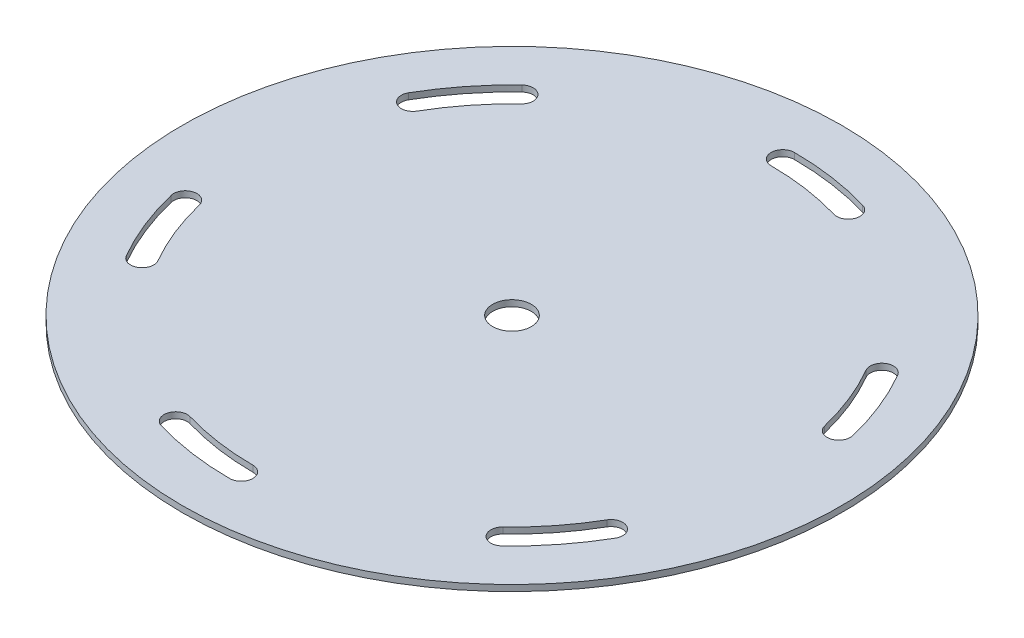
ISO-10303-21;
HEADER;
FILE_DESCRIPTION(('STEP AP214'),'2;1');
FILE_NAME('part.step','',(''),(''),'','','');
FILE_SCHEMA(('AUTOMOTIVE_DESIGN { 1 0 10303 214 1 1 1 1 }'));
ENDSEC;
DATA;
#1=APPLICATION_CONTEXT('core data for automotive mechanical design processes');
#2=APPLICATION_PROTOCOL_DEFINITION('international standard','automotive_design',2000,#1);
#3=PRODUCT_CONTEXT('',#1,'mechanical');
#4=PRODUCT('Part','Part','',(#3));
#5=PRODUCT_RELATED_PRODUCT_CATEGORY('part','',(#4));
#6=PRODUCT_DEFINITION_FORMATION('','',#4);
#7=PRODUCT_DEFINITION_CONTEXT('part definition',#1,'design');
#8=PRODUCT_DEFINITION('design','',#6,#7);
#9=PRODUCT_DEFINITION_SHAPE('','',#8);
#10=(LENGTH_UNIT() NAMED_UNIT(*) SI_UNIT(.MILLI.,.METRE.));
#11=(NAMED_UNIT(*) PLANE_ANGLE_UNIT() SI_UNIT($,.RADIAN.));
#12=(NAMED_UNIT(*) SI_UNIT($,.STERADIAN.) SOLID_ANGLE_UNIT());
#13=UNCERTAINTY_MEASURE_WITH_UNIT(LENGTH_MEASURE(1.E-05),#10,'distance_accuracy_value','');
#14=(GEOMETRIC_REPRESENTATION_CONTEXT(3) GLOBAL_UNCERTAINTY_ASSIGNED_CONTEXT((#13)) GLOBAL_UNIT_ASSIGNED_CONTEXT((#10,
#11,#12)) REPRESENTATION_CONTEXT('',''));
#15=CARTESIAN_POINT('',(0.,0.,0.));
#16=DIRECTION('',(0.,0.,1.));
#17=DIRECTION('',(1.,0.,0.));
#18=AXIS2_PLACEMENT_3D('',#15,#16,#17);
#19=CARTESIAN_POINT('',(0.,1.5875,0.));
#20=DIRECTION('',(0.,1.,0.));
#21=DIRECTION('',(0.,0.,1.));
#22=AXIS2_PLACEMENT_3D('',#19,#20,#21);
#23=PLANE('',#22);
#24=CARTESIAN_POINT('',(0.,1.5875,0.));
#25=DIRECTION('',(0.,1.,0.));
#26=DIRECTION('',(0.,0.,1.));
#27=AXIS2_PLACEMENT_3D('',#24,#25,#26);
#28=CIRCLE('',#27,85.2);
#29=CARTESIAN_POINT('',(0.,1.5875,85.2));
#30=VERTEX_POINT('',#29);
#31=EDGE_CURVE('E11',#30,#30,#28,.T.);
#32=ORIENTED_EDGE('',*,*,#31,.T.);
#33=EDGE_LOOP('',(#32));
#34=FACE_BOUND('',#33,.T.);
#35=CARTESIAN_POINT('',(0.,1.5875,0.));
#36=DIRECTION('',(0.,1.,0.));
#37=DIRECTION('',(0.,0.,1.));
#38=AXIS2_PLACEMENT_3D('',#35,#36,#37);
#39=CIRCLE('',#38,5.);
#40=CARTESIAN_POINT('',(0.,1.5875,5.));
#41=VERTEX_POINT('',#40);
#42=EDGE_CURVE('E385',#41,#41,#39,.T.);
#43=ORIENTED_EDGE('',*,*,#42,.F.);
#44=EDGE_LOOP('',(#43));
#45=FACE_BOUND('',#44,.T.);
#46=CARTESIAN_POINT('',(2.97021924916889E-12,1.5875,0.));
#47=DIRECTION('',(0.,1.,0.));
#48=DIRECTION('',(0.,0.,1.));
#49=AXIS2_PLACEMENT_3D('',#46,#47,#48);
#50=CIRCLE('',#49,73.0000000000003);
#51=CARTESIAN_POINT('',(70.9610611468298,1.5875,-17.132653061226));
#52=VERTEX_POINT('',#51);
#53=CARTESIAN_POINT('',(63.2198544762673,1.5875,-36.5));
#54=VERTEX_POINT('',#53);
#55=EDGE_CURVE('E356',#52,#54,#50,.T.);
#56=ORIENTED_EDGE('',*,*,#55,.F.);
#57=CARTESIAN_POINT('',(68.0448531544948,1.5875,-16.4285714285725));
#58=DIRECTION('',(0.,1.,0.));
#59=DIRECTION('',(0.,0.,1.));
#60=AXIS2_PLACEMENT_3D('',#57,#58,#59);
#61=CIRCLE('',#60,3.);
#62=CARTESIAN_POINT('',(65.1286451621581,1.5875,-15.7244897959186));
#63=VERTEX_POINT('',#62);
#64=EDGE_CURVE('E354',#63,#52,#61,.T.);
#65=ORIENTED_EDGE('',*,*,#64,.F.);
#66=CARTESIAN_POINT('',(2.97021924916889E-12,1.5875,0.));
#67=DIRECTION('',(0.,-1.,0.));
#68=DIRECTION('',(0.,0.,1.));
#69=AXIS2_PLACEMENT_3D('',#66,#67,#68);
#70=CIRCLE('',#69,66.999999999999);
#71=CARTESIAN_POINT('',(58.023702053559,1.5875,-33.5000000000002));
#72=VERTEX_POINT('',#71);
#73=EDGE_CURVE('E362',#72,#63,#70,.T.);
#74=ORIENTED_EDGE('',*,*,#73,.F.);
#75=CARTESIAN_POINT('',(60.6217782649108,1.5875,-34.9999999999999));
#76=DIRECTION('',(0.,1.,0.));
#77=DIRECTION('',(0.,0.,1.));
#78=AXIS2_PLACEMENT_3D('',#75,#76,#77);
#79=CIRCLE('',#78,3.00000000000128);
#80=EDGE_CURVE('E359',#54,#72,#79,.T.);
#81=ORIENTED_EDGE('',*,*,#80,.F.);
#82=EDGE_LOOP('',(#56,#65,#74,#81));
#83=FACE_BOUND('',#82,.T.);
#84=CARTESIAN_POINT('',(2.97021924916889E-12,1.5875,0.));
#85=DIRECTION('',(0.,1.,0.));
#86=DIRECTION('',(0.,0.,1.));
#87=AXIS2_PLACEMENT_3D('',#84,#85,#86);
#88=CIRCLE('',#87,73.);
#89=CARTESIAN_POINT('',(20.643217788171,1.5875,-70.0204081632653));
#90=VERTEX_POINT('',#89);
#91=CARTESIAN_POINT('',(-4.89621647336173E-13,1.5875,-73.));
#92=VERTEX_POINT('',#91);
#93=EDGE_CURVE('E325',#90,#92,#88,.T.);
#94=ORIENTED_EDGE('',*,*,#93,.F.);
#95=CARTESIAN_POINT('',(19.7948663722189,1.5875,-67.1428571428571));
#96=DIRECTION('',(0.,1.,0.));
#97=DIRECTION('',(0.,0.,1.));
#98=AXIS2_PLACEMENT_3D('',#95,#96,#97);
#99=CIRCLE('',#98,3.);
#100=CARTESIAN_POINT('',(18.9465149562668,1.5875,-64.2653061224489));
#101=VERTEX_POINT('',#100);
#102=EDGE_CURVE('E323',#101,#90,#99,.T.);
#103=ORIENTED_EDGE('',*,*,#102,.F.);
#104=CARTESIAN_POINT('',(2.97021924916889E-12,1.5875,0.));
#105=DIRECTION('',(0.,-1.,0.));
#106=DIRECTION('',(0.,0.,1.));
#107=AXIS2_PLACEMENT_3D('',#104,#105,#106);
#108=CIRCLE('',#107,67.);
#109=CARTESIAN_POINT('',(0.,1.5875,-67.));
#110=VERTEX_POINT('',#109);
#111=EDGE_CURVE('E331',#110,#101,#108,.T.);
#112=ORIENTED_EDGE('',*,*,#111,.F.);
#113=CARTESIAN_POINT('',(0.,1.5875,-70.));
#114=DIRECTION('',(0.,1.,0.));
#115=DIRECTION('',(0.,0.,1.));
#116=AXIS2_PLACEMENT_3D('',#113,#114,#115);
#117=CIRCLE('',#116,3.);
#118=EDGE_CURVE('E328',#92,#110,#117,.T.);
#119=ORIENTED_EDGE('',*,*,#118,.F.);
#120=EDGE_LOOP('',(#94,#103,#112,#119));
#121=FACE_BOUND('',#120,.T.);
#122=CARTESIAN_POINT('',(2.97021924916889E-12,1.5875,0.));
#123=DIRECTION('',(0.,1.,0.));
#124=DIRECTION('',(0.,0.,1.));
#125=AXIS2_PLACEMENT_3D('',#122,#123,#124);
#126=CIRCLE('',#125,72.9999999999994);
#127=CARTESIAN_POINT('',(50.3178433586606,1.5875,52.8877551020414));
#128=VERTEX_POINT('',#127);
#129=CARTESIAN_POINT('',(63.2198544762658,1.5875,36.5000000000008));
#130=VERTEX_POINT('',#129);
#131=EDGE_CURVE('E294',#128,#130,#126,.T.);
#132=ORIENTED_EDGE('',*,*,#131,.F.);
#133=CARTESIAN_POINT('',(48.2499867822783,1.5875,50.7142857142881));
#134=DIRECTION('',(0.,1.,0.));
#135=DIRECTION('',(0.,0.,1.));
#136=AXIS2_PLACEMENT_3D('',#133,#134,#135);
#137=CIRCLE('',#136,2.99999999999999);
#138=CARTESIAN_POINT('',(46.1821302058943,1.5875,48.5408163265328));
#139=VERTEX_POINT('',#138);
#140=EDGE_CURVE('E292',#139,#128,#137,.T.);
#141=ORIENTED_EDGE('',*,*,#140,.F.);
#142=CARTESIAN_POINT('',(2.97021924916889E-12,1.5875,0.));
#143=DIRECTION('',(0.,-1.,0.));
#144=DIRECTION('',(0.,0.,1.));
#145=AXIS2_PLACEMENT_3D('',#142,#143,#144);
#146=CIRCLE('',#145,67.0000000000007);
#147=CARTESIAN_POINT('',(58.0237020535609,1.5875,33.5000000000004));
#148=VERTEX_POINT('',#147);
#149=EDGE_CURVE('E300',#148,#139,#146,.T.);
#150=ORIENTED_EDGE('',*,*,#149,.F.);
#151=CARTESIAN_POINT('',(60.6217782649138,1.5875,34.9999999999999));
#152=DIRECTION('',(0.,1.,0.));
#153=DIRECTION('',(0.,0.,1.));
#154=AXIS2_PLACEMENT_3D('',#151,#152,#153);
#155=CIRCLE('',#154,2.99999999999871);
#156=EDGE_CURVE('E297',#130,#148,#155,.T.);
#157=ORIENTED_EDGE('',*,*,#156,.F.);
#158=EDGE_LOOP('',(#132,#141,#150,#157));
#159=FACE_BOUND('',#158,.T.);
#160=CARTESIAN_POINT('',(2.97021924916889E-12,1.5875,0.));
#161=DIRECTION('',(0.,1.,0.));
#162=DIRECTION('',(0.,0.,1.));
#163=AXIS2_PLACEMENT_3D('',#160,#161,#162);
#164=CIRCLE('',#163,73.);
#165=CARTESIAN_POINT('',(-20.6432177881651,1.5875,70.0204081632653));
#166=VERTEX_POINT('',#165);
#167=CARTESIAN_POINT('',(2.97021924916889E-12,1.5875,73.));
#168=VERTEX_POINT('',#167);
#169=EDGE_CURVE('E263',#166,#168,#164,.T.);
#170=ORIENTED_EDGE('',*,*,#169,.F.);
#171=CARTESIAN_POINT('',(-19.7948663722129,1.5875,67.1428571428571));
#172=DIRECTION('',(0.,1.,0.));
#173=DIRECTION('',(0.,0.,1.));
#174=AXIS2_PLACEMENT_3D('',#171,#172,#173);
#175=CIRCLE('',#174,3.);
#176=CARTESIAN_POINT('',(-18.9465149562609,1.5875,64.2653061224489));
#177=VERTEX_POINT('',#176);
#178=EDGE_CURVE('E261',#177,#166,#175,.T.);
#179=ORIENTED_EDGE('',*,*,#178,.F.);
#180=CARTESIAN_POINT('',(2.97021924916889E-12,1.5875,0.));
#181=DIRECTION('',(0.,-1.,0.));
#182=DIRECTION('',(0.,0.,1.));
#183=AXIS2_PLACEMENT_3D('',#180,#181,#182);
#184=CIRCLE('',#183,67.);
#185=CARTESIAN_POINT('',(2.97021924916889E-12,1.5875,67.));
#186=VERTEX_POINT('',#185);
#187=EDGE_CURVE('E269',#186,#177,#184,.T.);
#188=ORIENTED_EDGE('',*,*,#187,.F.);
#189=CARTESIAN_POINT('',(2.82051813152109E-12,1.5875,70.));
#190=DIRECTION('',(0.,1.,0.));
#191=DIRECTION('',(0.,0.,1.));
#192=AXIS2_PLACEMENT_3D('',#189,#190,#191);
#193=CIRCLE('',#192,3.);
#194=EDGE_CURVE('E266',#168,#186,#193,.T.);
#195=ORIENTED_EDGE('',*,*,#194,.F.);
#196=EDGE_LOOP('',(#170,#179,#188,#195));
#197=FACE_BOUND('',#196,.T.);
#198=CARTESIAN_POINT('',(2.97021924916889E-12,1.5875,0.));
#199=DIRECTION('',(0.,1.,0.));
#200=DIRECTION('',(0.,0.,1.));
#201=AXIS2_PLACEMENT_3D('',#198,#199,#200);
#202=CIRCLE('',#201,73.);
#203=CARTESIAN_POINT('',(-70.9610611468241,1.5875,17.1326530612243));
#204=VERTEX_POINT('',#203);
#205=CARTESIAN_POINT('',(-63.2198544762609,1.5875,36.5000000000002));
#206=VERTEX_POINT('',#205);
#207=EDGE_CURVE('E232',#204,#206,#202,.T.);
#208=ORIENTED_EDGE('',*,*,#207,.F.);
#209=CARTESIAN_POINT('',(-68.0448531544887,1.5875,16.4285714285713));
#210=DIRECTION('',(0.,1.,0.));
#211=DIRECTION('',(0.,0.,1.));
#212=AXIS2_PLACEMENT_3D('',#209,#210,#211);
#213=CIRCLE('',#212,2.99999999999999);
#214=CARTESIAN_POINT('',(-65.1286451621534,1.5875,15.7244897959182));
#215=VERTEX_POINT('',#214);
#216=EDGE_CURVE('E230',#215,#204,#213,.T.);
#217=ORIENTED_EDGE('',*,*,#216,.F.);
#218=CARTESIAN_POINT('',(2.97021924916889E-12,1.5875,0.));
#219=DIRECTION('',(0.,-1.,0.));
#220=DIRECTION('',(0.,0.,1.));
#221=AXIS2_PLACEMENT_3D('',#218,#219,#220);
#222=CIRCLE('',#221,67.);
#223=CARTESIAN_POINT('',(-58.0237020535545,1.5875,33.4999999999999));
#224=VERTEX_POINT('',#223);
#225=EDGE_CURVE('E238',#224,#215,#222,.T.);
#226=ORIENTED_EDGE('',*,*,#225,.F.);
#227=CARTESIAN_POINT('',(-60.6217782649078,1.5875,34.9999999999998));
#228=DIRECTION('',(0.,1.,0.));
#229=DIRECTION('',(0.,0.,1.));
#230=AXIS2_PLACEMENT_3D('',#227,#228,#229);
#231=CIRCLE('',#230,3.);
#232=EDGE_CURVE('E235',#206,#224,#231,.T.);
#233=ORIENTED_EDGE('',*,*,#232,.F.);
#234=EDGE_LOOP('',(#208,#217,#226,#233));
#235=FACE_BOUND('',#234,.T.);
#236=CARTESIAN_POINT('',(2.97021924916889E-12,1.5875,0.));
#237=DIRECTION('',(0.,1.,0.));
#238=DIRECTION('',(0.,0.,1.));
#239=AXIS2_PLACEMENT_3D('',#236,#237,#238);
#240=CIRCLE('',#239,73.0000000000013);
#241=CARTESIAN_POINT('',(-50.3178433586569,1.5875,-52.8877551020419));
#242=VERTEX_POINT('',#241);
#243=CARTESIAN_POINT('',(-63.2198544762627,1.5875,-36.4999999999997));
#244=VERTEX_POINT('',#243);
#245=EDGE_CURVE('E202',#242,#244,#240,.T.);
#246=ORIENTED_EDGE('',*,*,#245,.F.);
#247=CARTESIAN_POINT('',(-48.2499867822728,1.5875,-50.7142857142858));
#248=DIRECTION('',(0.,1.,0.));
#249=DIRECTION('',(0.,0.,1.));
#250=AXIS2_PLACEMENT_3D('',#247,#248,#249);
#251=CIRCLE('',#250,3.);
#252=CARTESIAN_POINT('',(-46.1821302058904,1.5875,-48.5408163265317));
#253=VERTEX_POINT('',#252);
#254=EDGE_CURVE('E194',#253,#242,#251,.T.);
#255=ORIENTED_EDGE('',*,*,#254,.F.);
#256=CARTESIAN_POINT('',(2.97021924916889E-12,1.5875,0.));
#257=DIRECTION('',(0.,-1.,0.));
#258=DIRECTION('',(0.,0.,1.));
#259=AXIS2_PLACEMENT_3D('',#256,#257,#258);
#260=CIRCLE('',#259,67.0000000000013);
#261=CARTESIAN_POINT('',(-58.0237020535556,1.5875,-33.5000000000005));
#262=VERTEX_POINT('',#261);
#263=EDGE_CURVE('E216',#262,#253,#260,.T.);
#264=ORIENTED_EDGE('',*,*,#263,.F.);
#265=CARTESIAN_POINT('',(-60.6217782649103,1.5875,-35.0000000000007));
#266=DIRECTION('',(0.,1.,0.));
#267=DIRECTION('',(0.,0.,1.));
#268=AXIS2_PLACEMENT_3D('',#265,#266,#267);
#269=CIRCLE('',#268,3.);
#270=EDGE_CURVE('E214',#244,#262,#269,.T.);
#271=ORIENTED_EDGE('',*,*,#270,.F.);
#272=EDGE_LOOP('',(#246,#255,#264,#271));
#273=FACE_BOUND('',#272,.T.);
#274=ADVANCED_FACE('F33',(#34,#45,#83,#121,#159,#197,#235,#273),#23,.T.);
#275=CARTESIAN_POINT('',(0.,0.,0.));
#276=DIRECTION('',(0.,1.,0.));
#277=DIRECTION('',(0.,0.,1.));
#278=AXIS2_PLACEMENT_3D('',#275,#276,#277);
#279=PLANE('',#278);
#280=CARTESIAN_POINT('',(-68.0448531544887,0.,16.4285714285713));
#281=DIRECTION('',(0.,1.,0.));
#282=DIRECTION('',(0.,0.,1.));
#283=AXIS2_PLACEMENT_3D('',#280,#281,#282);
#284=CIRCLE('',#283,2.99999999999999);
#285=CARTESIAN_POINT('',(-65.1286451621534,0.,15.7244897959182));
#286=VERTEX_POINT('',#285);
#287=CARTESIAN_POINT('',(-70.9610611468241,0.,17.1326530612243));
#288=VERTEX_POINT('',#287);
#289=EDGE_CURVE('E210',#286,#288,#284,.T.);
#290=ORIENTED_EDGE('',*,*,#289,.T.);
#291=CARTESIAN_POINT('',(2.97021924916889E-12,0.,0.));
#292=DIRECTION('',(0.,1.,0.));
#293=DIRECTION('',(0.,0.,1.));
#294=AXIS2_PLACEMENT_3D('',#291,#292,#293);
#295=CIRCLE('',#294,73.);
#296=CARTESIAN_POINT('',(-63.2198544762609,0.,36.5000000000002));
#297=VERTEX_POINT('',#296);
#298=EDGE_CURVE('E243',#288,#297,#295,.T.);
#299=ORIENTED_EDGE('',*,*,#298,.T.);
#300=CARTESIAN_POINT('',(-60.6217782649078,0.,34.9999999999998));
#301=DIRECTION('',(0.,1.,0.));
#302=DIRECTION('',(0.,0.,1.));
#303=AXIS2_PLACEMENT_3D('',#300,#301,#302);
#304=CIRCLE('',#303,3.);
#305=CARTESIAN_POINT('',(-58.0237020535545,0.,33.4999999999999));
#306=VERTEX_POINT('',#305);
#307=EDGE_CURVE('E246',#297,#306,#304,.T.);
#308=ORIENTED_EDGE('',*,*,#307,.T.);
#309=CARTESIAN_POINT('',(2.97021924916889E-12,0.,0.));
#310=DIRECTION('',(0.,-1.,0.));
#311=DIRECTION('',(0.,0.,1.));
#312=AXIS2_PLACEMENT_3D('',#309,#310,#311);
#313=CIRCLE('',#312,67.);
#314=EDGE_CURVE('E233',#306,#286,#313,.T.);
#315=ORIENTED_EDGE('',*,*,#314,.T.);
#316=EDGE_LOOP('',(#290,#299,#308,#315));
#317=FACE_BOUND('',#316,.T.);
#318=CARTESIAN_POINT('',(48.2499867822783,0.,50.7142857142881));
#319=DIRECTION('',(0.,1.,0.));
#320=DIRECTION('',(0.,0.,1.));
#321=AXIS2_PLACEMENT_3D('',#318,#319,#320);
#322=CIRCLE('',#321,2.99999999999999);
#323=CARTESIAN_POINT('',(46.1821302058943,0.,48.5408163265328));
#324=VERTEX_POINT('',#323);
#325=CARTESIAN_POINT('',(50.3178433586606,0.,52.8877551020414));
#326=VERTEX_POINT('',#325);
#327=EDGE_CURVE('E291',#324,#326,#322,.T.);
#328=ORIENTED_EDGE('',*,*,#327,.T.);
#329=CARTESIAN_POINT('',(2.97021924916889E-12,0.,0.));
#330=DIRECTION('',(0.,1.,0.));
#331=DIRECTION('',(0.,0.,1.));
#332=AXIS2_PLACEMENT_3D('',#329,#330,#331);
#333=CIRCLE('',#332,72.9999999999994);
#334=CARTESIAN_POINT('',(63.2198544762658,0.,36.5000000000008));
#335=VERTEX_POINT('',#334);
#336=EDGE_CURVE('E305',#326,#335,#333,.T.);
#337=ORIENTED_EDGE('',*,*,#336,.T.);
#338=CARTESIAN_POINT('',(60.6217782649138,0.,34.9999999999999));
#339=DIRECTION('',(0.,1.,0.));
#340=DIRECTION('',(0.,0.,1.));
#341=AXIS2_PLACEMENT_3D('',#338,#339,#340);
#342=CIRCLE('',#341,2.99999999999871);
#343=CARTESIAN_POINT('',(58.0237020535614,0.,33.5000000000007));
#344=VERTEX_POINT('',#343);
#345=EDGE_CURVE('E308',#335,#344,#342,.T.);
#346=ORIENTED_EDGE('',*,*,#345,.T.);
#347=CARTESIAN_POINT('',(2.97021924916889E-12,0.,0.));
#348=DIRECTION('',(0.,-1.,0.));
#349=DIRECTION('',(0.,0.,1.));
#350=AXIS2_PLACEMENT_3D('',#347,#348,#349);
#351=CIRCLE('',#350,67.0000000000007);
#352=EDGE_CURVE('E295',#344,#324,#351,.T.);
#353=ORIENTED_EDGE('',*,*,#352,.T.);
#354=EDGE_LOOP('',(#328,#337,#346,#353));
#355=FACE_BOUND('',#354,.T.);
#356=CARTESIAN_POINT('',(68.0448531544948,0.,-16.4285714285725));
#357=DIRECTION('',(0.,1.,0.));
#358=DIRECTION('',(0.,0.,1.));
#359=AXIS2_PLACEMENT_3D('',#356,#357,#358);
#360=CIRCLE('',#359,3.);
#361=CARTESIAN_POINT('',(65.1286451621581,0.,-15.7244897959186));
#362=VERTEX_POINT('',#361);
#363=CARTESIAN_POINT('',(70.9610611468298,0.,-17.132653061226));
#364=VERTEX_POINT('',#363);
#365=EDGE_CURVE('E353',#362,#364,#360,.T.);
#366=ORIENTED_EDGE('',*,*,#365,.T.);
#367=CARTESIAN_POINT('',(2.97021924916889E-12,0.,0.));
#368=DIRECTION('',(0.,1.,0.));
#369=DIRECTION('',(0.,0.,1.));
#370=AXIS2_PLACEMENT_3D('',#367,#368,#369);
#371=CIRCLE('',#370,73.0000000000003);
#372=CARTESIAN_POINT('',(63.2198544762673,0.,-36.5));
#373=VERTEX_POINT('',#372);
#374=EDGE_CURVE('E367',#364,#373,#371,.T.);
#375=ORIENTED_EDGE('',*,*,#374,.T.);
#376=CARTESIAN_POINT('',(60.6217782649108,0.,-34.9999999999999));
#377=DIRECTION('',(0.,1.,0.));
#378=DIRECTION('',(0.,0.,1.));
#379=AXIS2_PLACEMENT_3D('',#376,#377,#378);
#380=CIRCLE('',#379,3.00000000000128);
#381=CARTESIAN_POINT('',(58.0237020535566,0.,-33.4999999999988));
#382=VERTEX_POINT('',#381);
#383=EDGE_CURVE('E370',#373,#382,#380,.T.);
#384=ORIENTED_EDGE('',*,*,#383,.T.);
#385=CARTESIAN_POINT('',(2.97021924916889E-12,0.,0.));
#386=DIRECTION('',(0.,-1.,0.));
#387=DIRECTION('',(0.,0.,1.));
#388=AXIS2_PLACEMENT_3D('',#385,#386,#387);
#389=CIRCLE('',#388,66.999999999999);
#390=EDGE_CURVE('E357',#382,#362,#389,.T.);
#391=ORIENTED_EDGE('',*,*,#390,.T.);
#392=EDGE_LOOP('',(#366,#375,#384,#391));
#393=FACE_BOUND('',#392,.T.);
#394=CARTESIAN_POINT('',(0.,0.,0.));
#395=DIRECTION('',(0.,1.,0.));
#396=DIRECTION('',(0.,0.,1.));
#397=AXIS2_PLACEMENT_3D('',#394,#395,#396);
#398=CIRCLE('',#397,85.2);
#399=CARTESIAN_POINT('',(0.,0.,85.2));
#400=VERTEX_POINT('',#399);
#401=EDGE_CURVE('E37',#400,#400,#398,.T.);
#402=ORIENTED_EDGE('',*,*,#401,.F.);
#403=EDGE_LOOP('',(#402));
#404=FACE_BOUND('',#403,.T.);
#405=CARTESIAN_POINT('',(0.,0.,0.));
#406=DIRECTION('',(0.,1.,0.));
#407=DIRECTION('',(0.,0.,1.));
#408=AXIS2_PLACEMENT_3D('',#405,#406,#407);
#409=CIRCLE('',#408,5.);
#410=CARTESIAN_POINT('',(0.,0.,5.));
#411=VERTEX_POINT('',#410);
#412=EDGE_CURVE('E384',#411,#411,#409,.T.);
#413=ORIENTED_EDGE('',*,*,#412,.T.);
#414=EDGE_LOOP('',(#413));
#415=FACE_BOUND('',#414,.T.);
#416=CARTESIAN_POINT('',(19.7948663722189,0.,-67.1428571428571));
#417=DIRECTION('',(0.,1.,0.));
#418=DIRECTION('',(0.,0.,1.));
#419=AXIS2_PLACEMENT_3D('',#416,#417,#418);
#420=CIRCLE('',#419,3.);
#421=CARTESIAN_POINT('',(18.9465149562668,0.,-64.2653061224489));
#422=VERTEX_POINT('',#421);
#423=CARTESIAN_POINT('',(20.643217788171,0.,-70.0204081632653));
#424=VERTEX_POINT('',#423);
#425=EDGE_CURVE('E322',#422,#424,#420,.T.);
#426=ORIENTED_EDGE('',*,*,#425,.T.);
#427=CARTESIAN_POINT('',(2.97021924916889E-12,0.,0.));
#428=DIRECTION('',(0.,1.,0.));
#429=DIRECTION('',(0.,0.,1.));
#430=AXIS2_PLACEMENT_3D('',#427,#428,#429);
#431=CIRCLE('',#430,73.);
#432=CARTESIAN_POINT('',(-4.89621647336173E-13,0.,-73.));
#433=VERTEX_POINT('',#432);
#434=EDGE_CURVE('E336',#424,#433,#431,.T.);
#435=ORIENTED_EDGE('',*,*,#434,.T.);
#436=CARTESIAN_POINT('',(0.,0.,-70.));
#437=DIRECTION('',(0.,1.,0.));
#438=DIRECTION('',(0.,0.,1.));
#439=AXIS2_PLACEMENT_3D('',#436,#437,#438);
#440=CIRCLE('',#439,3.);
#441=CARTESIAN_POINT('',(0.,0.,-67.));
#442=VERTEX_POINT('',#441);
#443=EDGE_CURVE('E339',#433,#442,#440,.T.);
#444=ORIENTED_EDGE('',*,*,#443,.T.);
#445=CARTESIAN_POINT('',(2.97021924916889E-12,0.,0.));
#446=DIRECTION('',(0.,-1.,0.));
#447=DIRECTION('',(0.,0.,1.));
#448=AXIS2_PLACEMENT_3D('',#445,#446,#447);
#449=CIRCLE('',#448,67.);
#450=EDGE_CURVE('E326',#442,#422,#449,.T.);
#451=ORIENTED_EDGE('',*,*,#450,.T.);
#452=EDGE_LOOP('',(#426,#435,#444,#451));
#453=FACE_BOUND('',#452,.T.);
#454=CARTESIAN_POINT('',(-19.7948663722129,0.,67.1428571428571));
#455=DIRECTION('',(0.,1.,0.));
#456=DIRECTION('',(0.,0.,1.));
#457=AXIS2_PLACEMENT_3D('',#454,#455,#456);
#458=CIRCLE('',#457,3.);
#459=CARTESIAN_POINT('',(-18.9465149562609,0.,64.2653061224489));
#460=VERTEX_POINT('',#459);
#461=CARTESIAN_POINT('',(-20.6432177881651,0.,70.0204081632653));
#462=VERTEX_POINT('',#461);
#463=EDGE_CURVE('E260',#460,#462,#458,.T.);
#464=ORIENTED_EDGE('',*,*,#463,.T.);
#465=CARTESIAN_POINT('',(2.97021924916889E-12,0.,0.));
#466=DIRECTION('',(0.,1.,0.));
#467=DIRECTION('',(0.,0.,1.));
#468=AXIS2_PLACEMENT_3D('',#465,#466,#467);
#469=CIRCLE('',#468,73.);
#470=CARTESIAN_POINT('',(2.97021924916889E-12,0.,73.));
#471=VERTEX_POINT('',#470);
#472=EDGE_CURVE('E274',#462,#471,#469,.T.);
#473=ORIENTED_EDGE('',*,*,#472,.T.);
#474=CARTESIAN_POINT('',(2.82051813152109E-12,0.,70.));
#475=DIRECTION('',(0.,1.,0.));
#476=DIRECTION('',(0.,0.,1.));
#477=AXIS2_PLACEMENT_3D('',#474,#475,#476);
#478=CIRCLE('',#477,3.);
#479=CARTESIAN_POINT('',(2.82754686370859E-12,0.,67.));
#480=VERTEX_POINT('',#479);
#481=EDGE_CURVE('E277',#471,#480,#478,.T.);
#482=ORIENTED_EDGE('',*,*,#481,.T.);
#483=CARTESIAN_POINT('',(2.97021924916889E-12,0.,0.));
#484=DIRECTION('',(0.,-1.,0.));
#485=DIRECTION('',(0.,0.,1.));
#486=AXIS2_PLACEMENT_3D('',#483,#484,#485);
#487=CIRCLE('',#486,67.);
#488=EDGE_CURVE('E264',#480,#460,#487,.T.);
#489=ORIENTED_EDGE('',*,*,#488,.T.);
#490=EDGE_LOOP('',(#464,#473,#482,#489));
#491=FACE_BOUND('',#490,.T.);
#492=CARTESIAN_POINT('',(-48.2499867822728,0.,-50.7142857142858));
#493=DIRECTION('',(0.,1.,0.));
#494=DIRECTION('',(0.,0.,1.));
#495=AXIS2_PLACEMENT_3D('',#492,#493,#494);
#496=CIRCLE('',#495,3.);
#497=CARTESIAN_POINT('',(-46.1821302058904,0.,-48.5408163265317));
#498=VERTEX_POINT('',#497);
#499=CARTESIAN_POINT('',(-50.3178433586569,0.,-52.8877551020419));
#500=VERTEX_POINT('',#499);
#501=EDGE_CURVE('E56',#498,#500,#496,.T.);
#502=ORIENTED_EDGE('',*,*,#501,.T.);
#503=CARTESIAN_POINT('',(2.97021924916889E-12,0.,0.));
#504=DIRECTION('',(0.,1.,0.));
#505=DIRECTION('',(0.,0.,1.));
#506=AXIS2_PLACEMENT_3D('',#503,#504,#505);
#507=CIRCLE('',#506,73.0000000000013);
#508=CARTESIAN_POINT('',(-63.2198544762627,0.,-36.4999999999997));
#509=VERTEX_POINT('',#508);
#510=EDGE_CURVE('E209',#500,#509,#507,.T.);
#511=ORIENTED_EDGE('',*,*,#510,.T.);
#512=CARTESIAN_POINT('',(-60.6217782649103,0.,-35.0000000000007));
#513=DIRECTION('',(0.,1.,0.));
#514=DIRECTION('',(0.,0.,1.));
#515=AXIS2_PLACEMENT_3D('',#512,#513,#514);
#516=CIRCLE('',#515,3.);
#517=CARTESIAN_POINT('',(-58.0237020535567,0.,-33.5000000000011));
#518=VERTEX_POINT('',#517);
#519=EDGE_CURVE('E222',#509,#518,#516,.T.);
#520=ORIENTED_EDGE('',*,*,#519,.T.);
#521=CARTESIAN_POINT('',(2.97021924916889E-12,0.,0.));
#522=DIRECTION('',(0.,-1.,0.));
#523=DIRECTION('',(0.,0.,1.));
#524=AXIS2_PLACEMENT_3D('',#521,#522,#523);
#525=CIRCLE('',#524,67.0000000000013);
#526=EDGE_CURVE('E203',#518,#498,#525,.T.);
#527=ORIENTED_EDGE('',*,*,#526,.T.);
#528=EDGE_LOOP('',(#502,#511,#520,#527));
#529=FACE_BOUND('',#528,.T.);
#530=ADVANCED_FACE('F391',(#317,#355,#393,#404,#415,#453,#491,#529),#279,.F.);
#531=CARTESIAN_POINT('',(0.,1.5875,0.));
#532=DIRECTION('',(0.,-1.,0.));
#533=DIRECTION('',(0.,0.,-1.));
#534=AXIS2_PLACEMENT_3D('',#531,#532,#533);
#535=CYLINDRICAL_SURFACE('',#534,85.2);
#536=ORIENTED_EDGE('',*,*,#31,.F.);
#537=EDGE_LOOP('',(#536));
#538=FACE_BOUND('',#537,.T.);
#539=ORIENTED_EDGE('',*,*,#401,.T.);
#540=EDGE_LOOP('',(#539));
#541=FACE_BOUND('',#540,.T.);
#542=ADVANCED_FACE('F35',(#538,#541),#535,.T.);
#543=CARTESIAN_POINT('',(0.,1.5875,0.));
#544=DIRECTION('',(0.,-1.,0.));
#545=DIRECTION('',(0.,0.,-1.));
#546=AXIS2_PLACEMENT_3D('',#543,#544,#545);
#547=CYLINDRICAL_SURFACE('',#546,5.);
#548=ORIENTED_EDGE('',*,*,#42,.T.);
#549=EDGE_LOOP('',(#548));
#550=FACE_BOUND('',#549,.T.);
#551=ORIENTED_EDGE('',*,*,#412,.F.);
#552=EDGE_LOOP('',(#551));
#553=FACE_BOUND('',#552,.T.);
#554=ADVANCED_FACE('F394',(#550,#553),#547,.F.);
#555=CARTESIAN_POINT('',(68.0448531544948,1.5875,-16.4285714285725));
#556=DIRECTION('',(0.,-1.,0.));
#557=DIRECTION('',(0.,0.,-1.));
#558=AXIS2_PLACEMENT_3D('',#555,#556,#557);
#559=CYLINDRICAL_SURFACE('',#558,3.);
#560=ORIENTED_EDGE('',*,*,#365,.F.);
#561=DIRECTION('',(0.,-1.,0.));
#562=VECTOR('',#561,1.);
#563=CARTESIAN_POINT('',(65.1286451621581,1.5875,-15.7244897959186));
#564=LINE('',#563,#562);
#565=EDGE_CURVE('E364',#63,#362,#564,.T.);
#566=ORIENTED_EDGE('',*,*,#565,.F.);
#567=ORIENTED_EDGE('',*,*,#64,.T.);
#568=DIRECTION('',(0.,-1.,0.));
#569=VECTOR('',#568,1.);
#570=CARTESIAN_POINT('',(70.9610611468298,1.5875,-17.132653061226));
#571=LINE('',#570,#569);
#572=EDGE_CURVE('E381',#52,#364,#571,.T.);
#573=ORIENTED_EDGE('',*,*,#572,.T.);
#574=EDGE_LOOP('',(#560,#566,#567,#573));
#575=FACE_BOUND('',#574,.T.);
#576=ADVANCED_FACE('F396',(#575),#559,.F.);
#577=CARTESIAN_POINT('',(2.97021924916889E-12,1.5875,0.));
#578=DIRECTION('',(0.,-1.,0.));
#579=DIRECTION('',(0.,0.,-1.));
#580=AXIS2_PLACEMENT_3D('',#577,#578,#579);
#581=CYLINDRICAL_SURFACE('',#580,73.0000000000003);
#582=ORIENTED_EDGE('',*,*,#374,.F.);
#583=ORIENTED_EDGE('',*,*,#572,.F.);
#584=ORIENTED_EDGE('',*,*,#55,.T.);
#585=DIRECTION('',(0.,-1.,0.));
#586=VECTOR('',#585,1.);
#587=CARTESIAN_POINT('',(63.2198544762673,1.5875,-36.5));
#588=LINE('',#587,#586);
#589=EDGE_CURVE('E379',#54,#373,#588,.T.);
#590=ORIENTED_EDGE('',*,*,#589,.T.);
#591=EDGE_LOOP('',(#582,#583,#584,#590));
#592=FACE_BOUND('',#591,.T.);
#593=ADVANCED_FACE('F403',(#592),#581,.F.);
#594=CARTESIAN_POINT('',(60.6217782649108,1.5875,-34.9999999999999));
#595=DIRECTION('',(0.,-1.,0.));
#596=DIRECTION('',(0.,0.,-1.));
#597=AXIS2_PLACEMENT_3D('',#594,#595,#596);
#598=CYLINDRICAL_SURFACE('',#597,3.00000000000128);
#599=ORIENTED_EDGE('',*,*,#383,.F.);
#600=ORIENTED_EDGE('',*,*,#589,.F.);
#601=ORIENTED_EDGE('',*,*,#80,.T.);
#602=DIRECTION('',(0.,-1.,0.));
#603=VECTOR('',#602,1.);
#604=CARTESIAN_POINT('',(58.0237020535566,1.5875,-33.4999999999988));
#605=LINE('',#604,#603);
#606=EDGE_CURVE('E377',#72,#382,#605,.T.);
#607=ORIENTED_EDGE('',*,*,#606,.T.);
#608=EDGE_LOOP('',(#599,#600,#601,#607));
#609=FACE_BOUND('',#608,.T.);
#610=ADVANCED_FACE('F517',(#609),#598,.F.);
#611=CARTESIAN_POINT('',(2.97021924916889E-12,1.5875,0.));
#612=DIRECTION('',(0.,-1.,0.));
#613=DIRECTION('',(0.,0.,-1.));
#614=AXIS2_PLACEMENT_3D('',#611,#612,#613);
#615=CYLINDRICAL_SURFACE('',#614,66.999999999999);
#616=ORIENTED_EDGE('',*,*,#390,.F.);
#617=ORIENTED_EDGE('',*,*,#606,.F.);
#618=ORIENTED_EDGE('',*,*,#73,.T.);
#619=ORIENTED_EDGE('',*,*,#565,.T.);
#620=EDGE_LOOP('',(#616,#617,#618,#619));
#621=FACE_BOUND('',#620,.T.);
#622=ADVANCED_FACE('F513',(#621),#615,.T.);
#623=CARTESIAN_POINT('',(19.7948663722189,1.5875,-67.1428571428571));
#624=DIRECTION('',(0.,-1.,0.));
#625=DIRECTION('',(0.,0.,-1.));
#626=AXIS2_PLACEMENT_3D('',#623,#624,#625);
#627=CYLINDRICAL_SURFACE('',#626,3.);
#628=ORIENTED_EDGE('',*,*,#425,.F.);
#629=DIRECTION('',(0.,-1.,0.));
#630=VECTOR('',#629,1.);
#631=CARTESIAN_POINT('',(18.9465149562668,1.5875,-64.2653061224489));
#632=LINE('',#631,#630);
#633=EDGE_CURVE('E333',#101,#422,#632,.T.);
#634=ORIENTED_EDGE('',*,*,#633,.F.);
#635=ORIENTED_EDGE('',*,*,#102,.T.);
#636=DIRECTION('',(0.,-1.,0.));
#637=VECTOR('',#636,1.);
#638=CARTESIAN_POINT('',(20.643217788171,1.5875,-70.0204081632653));
#639=LINE('',#638,#637);
#640=EDGE_CURVE('E350',#90,#424,#639,.T.);
#641=ORIENTED_EDGE('',*,*,#640,.T.);
#642=EDGE_LOOP('',(#628,#634,#635,#641));
#643=FACE_BOUND('',#642,.T.);
#644=ADVANCED_FACE('F509',(#643),#627,.F.);
#645=CARTESIAN_POINT('',(2.97021924916889E-12,1.5875,0.));
#646=DIRECTION('',(0.,-1.,0.));
#647=DIRECTION('',(0.,0.,-1.));
#648=AXIS2_PLACEMENT_3D('',#645,#646,#647);
#649=CYLINDRICAL_SURFACE('',#648,73.);
#650=ORIENTED_EDGE('',*,*,#434,.F.);
#651=ORIENTED_EDGE('',*,*,#640,.F.);
#652=ORIENTED_EDGE('',*,*,#93,.T.);
#653=DIRECTION('',(0.,-1.,0.));
#654=VECTOR('',#653,1.);
#655=CARTESIAN_POINT('',(-4.89621647336173E-13,1.5875,-73.));
#656=LINE('',#655,#654);
#657=EDGE_CURVE('E348',#92,#433,#656,.T.);
#658=ORIENTED_EDGE('',*,*,#657,.T.);
#659=EDGE_LOOP('',(#650,#651,#652,#658));
#660=FACE_BOUND('',#659,.T.);
#661=ADVANCED_FACE('F505',(#660),#649,.F.);
#662=CARTESIAN_POINT('',(0.,1.5875,-70.));
#663=DIRECTION('',(0.,-1.,0.));
#664=DIRECTION('',(0.,0.,-1.));
#665=AXIS2_PLACEMENT_3D('',#662,#663,#664);
#666=CYLINDRICAL_SURFACE('',#665,3.);
#667=ORIENTED_EDGE('',*,*,#443,.F.);
#668=ORIENTED_EDGE('',*,*,#657,.F.);
#669=ORIENTED_EDGE('',*,*,#118,.T.);
#670=DIRECTION('',(0.,-1.,0.));
#671=VECTOR('',#670,1.);
#672=CARTESIAN_POINT('',(0.,1.5875,-67.));
#673=LINE('',#672,#671);
#674=EDGE_CURVE('E346',#110,#442,#673,.T.);
#675=ORIENTED_EDGE('',*,*,#674,.T.);
#676=EDGE_LOOP('',(#667,#668,#669,#675));
#677=FACE_BOUND('',#676,.T.);
#678=ADVANCED_FACE('F501',(#677),#666,.F.);
#679=CARTESIAN_POINT('',(2.97021924916889E-12,1.5875,0.));
#680=DIRECTION('',(0.,-1.,0.));
#681=DIRECTION('',(0.,0.,-1.));
#682=AXIS2_PLACEMENT_3D('',#679,#680,#681);
#683=CYLINDRICAL_SURFACE('',#682,67.);
#684=ORIENTED_EDGE('',*,*,#450,.F.);
#685=ORIENTED_EDGE('',*,*,#674,.F.);
#686=ORIENTED_EDGE('',*,*,#111,.T.);
#687=ORIENTED_EDGE('',*,*,#633,.T.);
#688=EDGE_LOOP('',(#684,#685,#686,#687));
#689=FACE_BOUND('',#688,.T.);
#690=ADVANCED_FACE('F497',(#689),#683,.T.);
#691=CARTESIAN_POINT('',(48.2499867822783,1.5875,50.7142857142881));
#692=DIRECTION('',(0.,-1.,0.));
#693=DIRECTION('',(0.,0.,-1.));
#694=AXIS2_PLACEMENT_3D('',#691,#692,#693);
#695=CYLINDRICAL_SURFACE('',#694,2.99999999999999);
#696=ORIENTED_EDGE('',*,*,#327,.F.);
#697=DIRECTION('',(0.,-1.,0.));
#698=VECTOR('',#697,1.);
#699=CARTESIAN_POINT('',(46.1821302058943,1.5875,48.5408163265328));
#700=LINE('',#699,#698);
#701=EDGE_CURVE('E302',#139,#324,#700,.T.);
#702=ORIENTED_EDGE('',*,*,#701,.F.);
#703=ORIENTED_EDGE('',*,*,#140,.T.);
#704=DIRECTION('',(0.,-1.,0.));
#705=VECTOR('',#704,1.);
#706=CARTESIAN_POINT('',(50.3178433586606,1.5875,52.8877551020414));
#707=LINE('',#706,#705);
#708=EDGE_CURVE('E319',#128,#326,#707,.T.);
#709=ORIENTED_EDGE('',*,*,#708,.T.);
#710=EDGE_LOOP('',(#696,#702,#703,#709));
#711=FACE_BOUND('',#710,.T.);
#712=ADVANCED_FACE('F493',(#711),#695,.F.);
#713=CARTESIAN_POINT('',(2.97021924916889E-12,1.5875,0.));
#714=DIRECTION('',(0.,-1.,0.));
#715=DIRECTION('',(0.,0.,-1.));
#716=AXIS2_PLACEMENT_3D('',#713,#714,#715);
#717=CYLINDRICAL_SURFACE('',#716,72.9999999999994);
#718=ORIENTED_EDGE('',*,*,#336,.F.);
#719=ORIENTED_EDGE('',*,*,#708,.F.);
#720=ORIENTED_EDGE('',*,*,#131,.T.);
#721=DIRECTION('',(0.,-1.,0.));
#722=VECTOR('',#721,1.);
#723=CARTESIAN_POINT('',(63.2198544762658,1.5875,36.5000000000008));
#724=LINE('',#723,#722);
#725=EDGE_CURVE('E317',#130,#335,#724,.T.);
#726=ORIENTED_EDGE('',*,*,#725,.T.);
#727=EDGE_LOOP('',(#718,#719,#720,#726));
#728=FACE_BOUND('',#727,.T.);
#729=ADVANCED_FACE('F489',(#728),#717,.F.);
#730=CARTESIAN_POINT('',(60.6217782649138,1.5875,34.9999999999999));
#731=DIRECTION('',(0.,-1.,0.));
#732=DIRECTION('',(0.,0.,-1.));
#733=AXIS2_PLACEMENT_3D('',#730,#731,#732);
#734=CYLINDRICAL_SURFACE('',#733,2.99999999999871);
#735=ORIENTED_EDGE('',*,*,#345,.F.);
#736=ORIENTED_EDGE('',*,*,#725,.F.);
#737=ORIENTED_EDGE('',*,*,#156,.T.);
#738=DIRECTION('',(0.,-1.,0.));
#739=VECTOR('',#738,1.);
#740=CARTESIAN_POINT('',(58.0237020535614,1.5875,33.5000000000007));
#741=LINE('',#740,#739);
#742=EDGE_CURVE('E315',#148,#344,#741,.T.);
#743=ORIENTED_EDGE('',*,*,#742,.T.);
#744=EDGE_LOOP('',(#735,#736,#737,#743));
#745=FACE_BOUND('',#744,.T.);
#746=ADVANCED_FACE('F485',(#745),#734,.F.);
#747=CARTESIAN_POINT('',(2.97021924916889E-12,1.5875,0.));
#748=DIRECTION('',(0.,-1.,0.));
#749=DIRECTION('',(0.,0.,-1.));
#750=AXIS2_PLACEMENT_3D('',#747,#748,#749);
#751=CYLINDRICAL_SURFACE('',#750,67.0000000000007);
#752=ORIENTED_EDGE('',*,*,#352,.F.);
#753=ORIENTED_EDGE('',*,*,#742,.F.);
#754=ORIENTED_EDGE('',*,*,#149,.T.);
#755=ORIENTED_EDGE('',*,*,#701,.T.);
#756=EDGE_LOOP('',(#752,#753,#754,#755));
#757=FACE_BOUND('',#756,.T.);
#758=ADVANCED_FACE('F481',(#757),#751,.T.);
#759=CARTESIAN_POINT('',(-19.7948663722129,1.5875,67.1428571428571));
#760=DIRECTION('',(0.,-1.,0.));
#761=DIRECTION('',(0.,0.,-1.));
#762=AXIS2_PLACEMENT_3D('',#759,#760,#761);
#763=CYLINDRICAL_SURFACE('',#762,3.);
#764=ORIENTED_EDGE('',*,*,#463,.F.);
#765=DIRECTION('',(0.,-1.,0.));
#766=VECTOR('',#765,1.);
#767=CARTESIAN_POINT('',(-18.9465149562609,1.5875,64.2653061224489));
#768=LINE('',#767,#766);
#769=EDGE_CURVE('E271',#177,#460,#768,.T.);
#770=ORIENTED_EDGE('',*,*,#769,.F.);
#771=ORIENTED_EDGE('',*,*,#178,.T.);
#772=DIRECTION('',(0.,-1.,0.));
#773=VECTOR('',#772,1.);
#774=CARTESIAN_POINT('',(-20.6432177881651,1.5875,70.0204081632653));
#775=LINE('',#774,#773);
#776=EDGE_CURVE('E288',#166,#462,#775,.T.);
#777=ORIENTED_EDGE('',*,*,#776,.T.);
#778=EDGE_LOOP('',(#764,#770,#771,#777));
#779=FACE_BOUND('',#778,.T.);
#780=ADVANCED_FACE('F477',(#779),#763,.F.);
#781=CARTESIAN_POINT('',(2.97021924916889E-12,1.5875,0.));
#782=DIRECTION('',(0.,-1.,0.));
#783=DIRECTION('',(0.,0.,-1.));
#784=AXIS2_PLACEMENT_3D('',#781,#782,#783);
#785=CYLINDRICAL_SURFACE('',#784,73.);
#786=ORIENTED_EDGE('',*,*,#472,.F.);
#787=ORIENTED_EDGE('',*,*,#776,.F.);
#788=ORIENTED_EDGE('',*,*,#169,.T.);
#789=DIRECTION('',(0.,-1.,0.));
#790=VECTOR('',#789,1.);
#791=CARTESIAN_POINT('',(2.97021924916889E-12,1.5875,73.));
#792=LINE('',#791,#790);
#793=EDGE_CURVE('E286',#168,#471,#792,.T.);
#794=ORIENTED_EDGE('',*,*,#793,.T.);
#795=EDGE_LOOP('',(#786,#787,#788,#794));
#796=FACE_BOUND('',#795,.T.);
#797=ADVANCED_FACE('F473',(#796),#785,.F.);
#798=CARTESIAN_POINT('',(2.82051813152109E-12,1.5875,70.));
#799=DIRECTION('',(0.,-1.,0.));
#800=DIRECTION('',(0.,0.,-1.));
#801=AXIS2_PLACEMENT_3D('',#798,#799,#800);
#802=CYLINDRICAL_SURFACE('',#801,3.);
#803=ORIENTED_EDGE('',*,*,#481,.F.);
#804=ORIENTED_EDGE('',*,*,#793,.F.);
#805=ORIENTED_EDGE('',*,*,#194,.T.);
#806=DIRECTION('',(0.,-1.,0.));
#807=VECTOR('',#806,1.);
#808=CARTESIAN_POINT('',(2.82754686370859E-12,1.5875,67.));
#809=LINE('',#808,#807);
#810=EDGE_CURVE('E284',#186,#480,#809,.T.);
#811=ORIENTED_EDGE('',*,*,#810,.T.);
#812=EDGE_LOOP('',(#803,#804,#805,#811));
#813=FACE_BOUND('',#812,.T.);
#814=ADVANCED_FACE('F469',(#813),#802,.F.);
#815=CARTESIAN_POINT('',(2.97021924916889E-12,1.5875,0.));
#816=DIRECTION('',(0.,-1.,0.));
#817=DIRECTION('',(0.,0.,-1.));
#818=AXIS2_PLACEMENT_3D('',#815,#816,#817);
#819=CYLINDRICAL_SURFACE('',#818,67.);
#820=ORIENTED_EDGE('',*,*,#488,.F.);
#821=ORIENTED_EDGE('',*,*,#810,.F.);
#822=ORIENTED_EDGE('',*,*,#187,.T.);
#823=ORIENTED_EDGE('',*,*,#769,.T.);
#824=EDGE_LOOP('',(#820,#821,#822,#823));
#825=FACE_BOUND('',#824,.T.);
#826=ADVANCED_FACE('F466',(#825),#819,.T.);
#827=CARTESIAN_POINT('',(-68.0448531544887,1.5875,16.4285714285713));
#828=DIRECTION('',(0.,-1.,0.));
#829=DIRECTION('',(0.,0.,-1.));
#830=AXIS2_PLACEMENT_3D('',#827,#828,#829);
#831=CYLINDRICAL_SURFACE('',#830,2.99999999999999);
#832=ORIENTED_EDGE('',*,*,#289,.F.);
#833=DIRECTION('',(0.,-1.,0.));
#834=VECTOR('',#833,1.);
#835=CARTESIAN_POINT('',(-65.1286451621534,1.5875,15.7244897959182));
#836=LINE('',#835,#834);
#837=EDGE_CURVE('E240',#215,#286,#836,.T.);
#838=ORIENTED_EDGE('',*,*,#837,.F.);
#839=ORIENTED_EDGE('',*,*,#216,.T.);
#840=DIRECTION('',(0.,-1.,0.));
#841=VECTOR('',#840,1.);
#842=CARTESIAN_POINT('',(-70.9610611468241,1.5875,17.1326530612243));
#843=LINE('',#842,#841);
#844=EDGE_CURVE('E257',#204,#288,#843,.T.);
#845=ORIENTED_EDGE('',*,*,#844,.T.);
#846=EDGE_LOOP('',(#832,#838,#839,#845));
#847=FACE_BOUND('',#846,.T.);
#848=ADVANCED_FACE('F448',(#847),#831,.F.);
#849=CARTESIAN_POINT('',(2.97021924916889E-12,1.5875,0.));
#850=DIRECTION('',(0.,-1.,0.));
#851=DIRECTION('',(0.,0.,-1.));
#852=AXIS2_PLACEMENT_3D('',#849,#850,#851);
#853=CYLINDRICAL_SURFACE('',#852,73.);
#854=ORIENTED_EDGE('',*,*,#298,.F.);
#855=ORIENTED_EDGE('',*,*,#844,.F.);
#856=ORIENTED_EDGE('',*,*,#207,.T.);
#857=DIRECTION('',(0.,-1.,0.));
#858=VECTOR('',#857,1.);
#859=CARTESIAN_POINT('',(-63.2198544762609,1.5875,36.5000000000002));
#860=LINE('',#859,#858);
#861=EDGE_CURVE('E255',#206,#297,#860,.T.);
#862=ORIENTED_EDGE('',*,*,#861,.T.);
#863=EDGE_LOOP('',(#854,#855,#856,#862));
#864=FACE_BOUND('',#863,.T.);
#865=ADVANCED_FACE('F441',(#864),#853,.F.);
#866=CARTESIAN_POINT('',(-60.6217782649078,1.5875,34.9999999999998));
#867=DIRECTION('',(0.,-1.,0.));
#868=DIRECTION('',(0.,0.,-1.));
#869=AXIS2_PLACEMENT_3D('',#866,#867,#868);
#870=CYLINDRICAL_SURFACE('',#869,3.);
#871=ORIENTED_EDGE('',*,*,#307,.F.);
#872=ORIENTED_EDGE('',*,*,#861,.F.);
#873=ORIENTED_EDGE('',*,*,#232,.T.);
#874=DIRECTION('',(0.,-1.,0.));
#875=VECTOR('',#874,1.);
#876=CARTESIAN_POINT('',(-58.0237020535545,1.5875,33.4999999999999));
#877=LINE('',#876,#875);
#878=EDGE_CURVE('E253',#224,#306,#877,.T.);
#879=ORIENTED_EDGE('',*,*,#878,.T.);
#880=EDGE_LOOP('',(#871,#872,#873,#879));
#881=FACE_BOUND('',#880,.T.);
#882=ADVANCED_FACE('F444',(#881),#870,.F.);
#883=CARTESIAN_POINT('',(2.97021924916889E-12,1.5875,0.));
#884=DIRECTION('',(0.,-1.,0.));
#885=DIRECTION('',(0.,0.,-1.));
#886=AXIS2_PLACEMENT_3D('',#883,#884,#885);
#887=CYLINDRICAL_SURFACE('',#886,67.);
#888=ORIENTED_EDGE('',*,*,#314,.F.);
#889=ORIENTED_EDGE('',*,*,#878,.F.);
#890=ORIENTED_EDGE('',*,*,#225,.T.);
#891=ORIENTED_EDGE('',*,*,#837,.T.);
#892=EDGE_LOOP('',(#888,#889,#890,#891));
#893=FACE_BOUND('',#892,.T.);
#894=ADVANCED_FACE('F451',(#893),#887,.T.);
#895=CARTESIAN_POINT('',(-48.2499867822728,1.5875,-50.7142857142858));
#896=DIRECTION('',(0.,-1.,0.));
#897=DIRECTION('',(0.,0.,-1.));
#898=AXIS2_PLACEMENT_3D('',#895,#896,#897);
#899=CYLINDRICAL_SURFACE('',#898,3.);
#900=ORIENTED_EDGE('',*,*,#501,.F.);
#901=DIRECTION('',(0.,-1.,0.));
#902=VECTOR('',#901,1.);
#903=CARTESIAN_POINT('',(-46.1821302058904,1.5875,-48.5408163265317));
#904=LINE('',#903,#902);
#905=EDGE_CURVE('E198',#253,#498,#904,.T.);
#906=ORIENTED_EDGE('',*,*,#905,.F.);
#907=ORIENTED_EDGE('',*,*,#254,.T.);
#908=DIRECTION('',(0.,-1.,0.));
#909=VECTOR('',#908,1.);
#910=CARTESIAN_POINT('',(-50.3178433586569,1.5875,-52.8877551020419));
#911=LINE('',#910,#909);
#912=EDGE_CURVE('E197',#242,#500,#911,.T.);
#913=ORIENTED_EDGE('',*,*,#912,.T.);
#914=EDGE_LOOP('',(#900,#906,#907,#913));
#915=FACE_BOUND('',#914,.T.);
#916=ADVANCED_FACE('F196',(#915),#899,.F.);
#917=CARTESIAN_POINT('',(2.97021924916889E-12,1.5875,0.));
#918=DIRECTION('',(0.,-1.,0.));
#919=DIRECTION('',(0.,0.,-1.));
#920=AXIS2_PLACEMENT_3D('',#917,#918,#919);
#921=CYLINDRICAL_SURFACE('',#920,73.0000000000013);
#922=ORIENTED_EDGE('',*,*,#510,.F.);
#923=ORIENTED_EDGE('',*,*,#912,.F.);
#924=ORIENTED_EDGE('',*,*,#245,.T.);
#925=DIRECTION('',(0.,-1.,0.));
#926=VECTOR('',#925,1.);
#927=CARTESIAN_POINT('',(-63.2198544762627,1.5875,-36.4999999999997));
#928=LINE('',#927,#926);
#929=EDGE_CURVE('E211',#244,#509,#928,.T.);
#930=ORIENTED_EDGE('',*,*,#929,.T.);
#931=EDGE_LOOP('',(#922,#923,#924,#930));
#932=FACE_BOUND('',#931,.T.);
#933=ADVANCED_FACE('F206',(#932),#921,.F.);
#934=CARTESIAN_POINT('',(-60.6217782649103,1.5875,-35.0000000000007));
#935=DIRECTION('',(0.,-1.,0.));
#936=DIRECTION('',(0.,0.,-1.));
#937=AXIS2_PLACEMENT_3D('',#934,#935,#936);
#938=CYLINDRICAL_SURFACE('',#937,3.);
#939=ORIENTED_EDGE('',*,*,#519,.F.);
#940=ORIENTED_EDGE('',*,*,#929,.F.);
#941=ORIENTED_EDGE('',*,*,#270,.T.);
#942=DIRECTION('',(0.,-1.,0.));
#943=VECTOR('',#942,1.);
#944=CARTESIAN_POINT('',(-58.0237020535567,1.5875,-33.5000000000011));
#945=LINE('',#944,#943);
#946=EDGE_CURVE('E48',#262,#518,#945,.T.);
#947=ORIENTED_EDGE('',*,*,#946,.T.);
#948=EDGE_LOOP('',(#939,#940,#941,#947));
#949=FACE_BOUND('',#948,.T.);
#950=ADVANCED_FACE('F626',(#949),#938,.F.);
#951=CARTESIAN_POINT('',(2.97021924916889E-12,1.5875,0.));
#952=DIRECTION('',(0.,-1.,0.));
#953=DIRECTION('',(0.,0.,-1.));
#954=AXIS2_PLACEMENT_3D('',#951,#952,#953);
#955=CYLINDRICAL_SURFACE('',#954,67.0000000000013);
#956=ORIENTED_EDGE('',*,*,#526,.F.);
#957=ORIENTED_EDGE('',*,*,#946,.F.);
#958=ORIENTED_EDGE('',*,*,#263,.T.);
#959=ORIENTED_EDGE('',*,*,#905,.T.);
#960=EDGE_LOOP('',(#956,#957,#958,#959));
#961=FACE_BOUND('',#960,.T.);
#962=ADVANCED_FACE('F634',(#961),#955,.T.);
#963=CLOSED_SHELL('',(#274,#530,#542,#554,#576,#593,#610,#622,#644,#661,#678,#690,#712,#729,
#746,#758,#780,#797,#814,#826,#848,#865,#882,#894,#916,#933,#950,#962));
#964=MANIFOLD_SOLID_BREP('B2',#963);
#965=ADVANCED_BREP_SHAPE_REPRESENTATION('',(#18,#964),#14);
#966=SHAPE_DEFINITION_REPRESENTATION(#9,#965);
ENDSEC;
END-ISO-10303-21;
